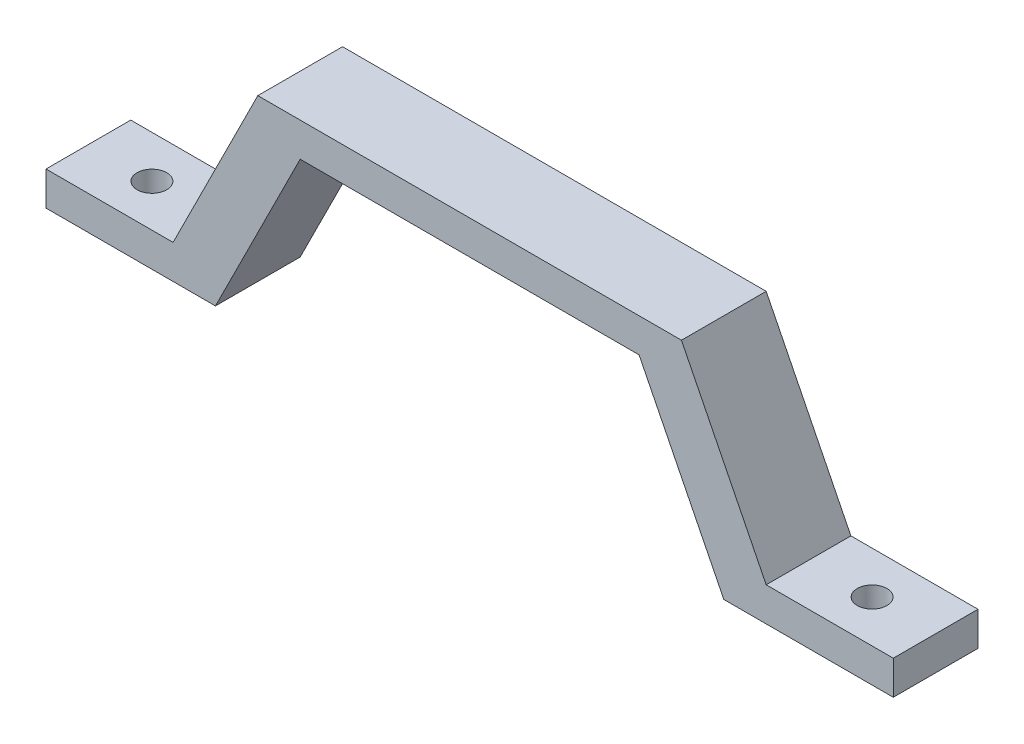
ISO-10303-21;
HEADER;
FILE_DESCRIPTION(('STEP AP214'),'2;1');
FILE_NAME('part.step','',(''),(''),'','','');
FILE_SCHEMA(('AUTOMOTIVE_DESIGN { 1 0 10303 214 1 1 1 1 }'));
ENDSEC;
DATA;
#1=APPLICATION_CONTEXT('core data for automotive mechanical design processes');
#2=APPLICATION_PROTOCOL_DEFINITION('international standard','automotive_design',2000,#1);
#3=PRODUCT_CONTEXT('',#1,'mechanical');
#4=PRODUCT('Part','Part','',(#3));
#5=PRODUCT_RELATED_PRODUCT_CATEGORY('part','',(#4));
#6=PRODUCT_DEFINITION_FORMATION('','',#4);
#7=PRODUCT_DEFINITION_CONTEXT('part definition',#1,'design');
#8=PRODUCT_DEFINITION('design','',#6,#7);
#9=PRODUCT_DEFINITION_SHAPE('','',#8);
#10=(LENGTH_UNIT() NAMED_UNIT(*) SI_UNIT(.MILLI.,.METRE.));
#11=(NAMED_UNIT(*) PLANE_ANGLE_UNIT() SI_UNIT($,.RADIAN.));
#12=(NAMED_UNIT(*) SI_UNIT($,.STERADIAN.) SOLID_ANGLE_UNIT());
#13=UNCERTAINTY_MEASURE_WITH_UNIT(LENGTH_MEASURE(1.E-05),#10,'distance_accuracy_value','');
#14=(GEOMETRIC_REPRESENTATION_CONTEXT(3) GLOBAL_UNCERTAINTY_ASSIGNED_CONTEXT((#13)) GLOBAL_UNIT_ASSIGNED_CONTEXT((#10,
#11,#12)) REPRESENTATION_CONTEXT('',''));
#15=CARTESIAN_POINT('',(0.,0.,0.));
#16=DIRECTION('',(0.,0.,1.));
#17=DIRECTION('',(1.,0.,0.));
#18=AXIS2_PLACEMENT_3D('',#15,#16,#17);
#19=CARTESIAN_POINT('',(20.,20.,10.));
#20=DIRECTION('',(0.,1.,0.));
#21=DIRECTION('',(0.,0.,1.));
#22=AXIS2_PLACEMENT_3D('',#19,#20,#21);
#23=PLANE('',#22);
#24=DIRECTION('',(1.,0.,0.));
#25=VECTOR('',#24,1.);
#26=CARTESIAN_POINT('',(20.,20.,0.));
#27=LINE('',#26,#25);
#28=CARTESIAN_POINT('',(-20.,20.,0.));
#29=VERTEX_POINT('',#28);
#30=CARTESIAN_POINT('',(20.,20.,0.));
#31=VERTEX_POINT('',#30);
#32=EDGE_CURVE('E157',#29,#31,#27,.T.);
#33=ORIENTED_EDGE('',*,*,#32,.T.);
#34=DIRECTION('',(0.,0.,-1.));
#35=VECTOR('',#34,1.);
#36=CARTESIAN_POINT('',(20.,20.,10.));
#37=LINE('',#36,#35);
#38=CARTESIAN_POINT('',(20.,20.,10.));
#39=VERTEX_POINT('',#38);
#40=EDGE_CURVE('E11',#39,#31,#37,.T.);
#41=ORIENTED_EDGE('',*,*,#40,.F.);
#42=DIRECTION('',(1.,0.,0.));
#43=VECTOR('',#42,1.);
#44=CARTESIAN_POINT('',(20.,20.,10.));
#45=LINE('',#44,#43);
#46=CARTESIAN_POINT('',(-20.,20.,10.));
#47=VERTEX_POINT('',#46);
#48=EDGE_CURVE('E180',#47,#39,#45,.T.);
#49=ORIENTED_EDGE('',*,*,#48,.F.);
#50=DIRECTION('',(0.,0.,-1.));
#51=VECTOR('',#50,1.);
#52=CARTESIAN_POINT('',(-20.,20.,10.));
#53=LINE('',#52,#51);
#54=EDGE_CURVE('E153',#47,#29,#53,.T.);
#55=ORIENTED_EDGE('',*,*,#54,.T.);
#56=EDGE_LOOP('',(#33,#41,#49,#55));
#57=FACE_BOUND('',#56,.T.);
#58=ADVANCED_FACE('F37',(#57),#23,.F.);
#59=CARTESIAN_POINT('',(20.,20.,10.));
#60=DIRECTION('',(0.894427190999916,0.447213595499958,0.));
#61=DIRECTION('',(-0.447213595499958,0.894427190999916,0.));
#62=AXIS2_PLACEMENT_3D('',#59,#60,#61);
#63=PLANE('',#62);
#64=DIRECTION('',(0.447213595499958,-0.894427190999916,0.));
#65=VECTOR('',#64,1.);
#66=CARTESIAN_POINT('',(20.,20.,0.));
#67=LINE('',#66,#65);
#68=CARTESIAN_POINT('',(30.,0.,0.));
#69=VERTEX_POINT('',#68);
#70=EDGE_CURVE('E160',#31,#69,#67,.T.);
#71=ORIENTED_EDGE('',*,*,#70,.T.);
#72=DIRECTION('',(0.,0.,-1.));
#73=VECTOR('',#72,1.);
#74=CARTESIAN_POINT('',(30.,0.,10.));
#75=LINE('',#74,#73);
#76=CARTESIAN_POINT('',(30.,0.,10.));
#77=VERTEX_POINT('',#76);
#78=EDGE_CURVE('E45',#77,#69,#75,.T.);
#79=ORIENTED_EDGE('',*,*,#78,.F.);
#80=DIRECTION('',(0.447213595499958,-0.894427190999916,0.));
#81=VECTOR('',#80,1.);
#82=CARTESIAN_POINT('',(20.,20.,10.));
#83=LINE('',#82,#81);
#84=EDGE_CURVE('E108',#39,#77,#83,.T.);
#85=ORIENTED_EDGE('',*,*,#84,.F.);
#86=ORIENTED_EDGE('',*,*,#40,.T.);
#87=EDGE_LOOP('',(#71,#79,#85,#86));
#88=FACE_BOUND('',#87,.T.);
#89=ADVANCED_FACE('F259',(#88),#63,.F.);
#90=CARTESIAN_POINT('',(30.,0.,10.));
#91=DIRECTION('',(0.,1.,0.));
#92=DIRECTION('',(-1.,0.,0.));
#93=AXIS2_PLACEMENT_3D('',#90,#91,#92);
#94=PLANE('',#93);
#95=CARTESIAN_POINT('',(42.5,0.,5.));
#96=DIRECTION('',(0.,1.,0.));
#97=DIRECTION('',(-1.,0.,0.));
#98=AXIS2_PLACEMENT_3D('',#95,#96,#97);
#99=CIRCLE('',#98,1.75);
#100=CARTESIAN_POINT('',(40.75,0.,5.));
#101=VERTEX_POINT('',#100);
#102=EDGE_CURVE('E161',#101,#101,#99,.T.);
#103=ORIENTED_EDGE('',*,*,#102,.T.);
#104=EDGE_LOOP('',(#103));
#105=FACE_BOUND('',#104,.T.);
#106=DIRECTION('',(1.,0.,0.));
#107=VECTOR('',#106,1.);
#108=CARTESIAN_POINT('',(30.,0.,0.));
#109=LINE('',#108,#107);
#110=CARTESIAN_POINT('',(50.,0.,0.));
#111=VERTEX_POINT('',#110);
#112=EDGE_CURVE('E163',#69,#111,#109,.T.);
#113=ORIENTED_EDGE('',*,*,#112,.T.);
#114=DIRECTION('',(0.,0.,-1.));
#115=VECTOR('',#114,1.);
#116=CARTESIAN_POINT('',(50.,0.,10.));
#117=LINE('',#116,#115);
#118=CARTESIAN_POINT('',(50.,0.,10.));
#119=VERTEX_POINT('',#118);
#120=EDGE_CURVE('E199',#119,#111,#117,.T.);
#121=ORIENTED_EDGE('',*,*,#120,.F.);
#122=DIRECTION('',(1.,0.,0.));
#123=VECTOR('',#122,1.);
#124=CARTESIAN_POINT('',(30.,0.,10.));
#125=LINE('',#124,#123);
#126=EDGE_CURVE('E207',#77,#119,#125,.T.);
#127=ORIENTED_EDGE('',*,*,#126,.F.);
#128=ORIENTED_EDGE('',*,*,#78,.T.);
#129=EDGE_LOOP('',(#113,#121,#127,#128));
#130=FACE_BOUND('',#129,.T.);
#131=ADVANCED_FACE('F205',(#105,#130),#94,.F.);
#132=CARTESIAN_POINT('',(50.,0.,10.));
#133=DIRECTION('',(-1.,0.,0.));
#134=DIRECTION('',(0.,0.,1.));
#135=AXIS2_PLACEMENT_3D('',#132,#133,#134);
#136=PLANE('',#135);
#137=DIRECTION('',(0.,1.,0.));
#138=VECTOR('',#137,1.);
#139=CARTESIAN_POINT('',(50.,0.,0.));
#140=LINE('',#139,#138);
#141=CARTESIAN_POINT('',(50.,4.,0.));
#142=VERTEX_POINT('',#141);
#143=EDGE_CURVE('E165',#111,#142,#140,.T.);
#144=ORIENTED_EDGE('',*,*,#143,.T.);
#145=DIRECTION('',(0.,0.,-1.));
#146=VECTOR('',#145,1.);
#147=CARTESIAN_POINT('',(50.,4.,10.));
#148=LINE('',#147,#146);
#149=CARTESIAN_POINT('',(50.,4.,10.));
#150=VERTEX_POINT('',#149);
#151=EDGE_CURVE('E196',#150,#142,#148,.T.);
#152=ORIENTED_EDGE('',*,*,#151,.F.);
#153=DIRECTION('',(0.,1.,0.));
#154=VECTOR('',#153,1.);
#155=CARTESIAN_POINT('',(50.,0.,10.));
#156=LINE('',#155,#154);
#157=EDGE_CURVE('E225',#119,#150,#156,.T.);
#158=ORIENTED_EDGE('',*,*,#157,.F.);
#159=ORIENTED_EDGE('',*,*,#120,.T.);
#160=EDGE_LOOP('',(#144,#152,#158,#159));
#161=FACE_BOUND('',#160,.T.);
#162=ADVANCED_FACE('F216',(#161),#136,.F.);
#163=CARTESIAN_POINT('',(50.,4.,10.));
#164=DIRECTION('',(0.,-1.,0.));
#165=DIRECTION('',(1.,0.,0.));
#166=AXIS2_PLACEMENT_3D('',#163,#164,#165);
#167=PLANE('',#166);
#168=CARTESIAN_POINT('',(42.5,4.,5.));
#169=DIRECTION('',(0.,1.,0.));
#170=DIRECTION('',(-1.,0.,0.));
#171=AXIS2_PLACEMENT_3D('',#168,#169,#170);
#172=CIRCLE('',#171,1.75);
#173=CARTESIAN_POINT('',(40.75,4.,5.));
#174=VERTEX_POINT('',#173);
#175=EDGE_CURVE('E395',#174,#174,#172,.T.);
#176=ORIENTED_EDGE('',*,*,#175,.F.);
#177=EDGE_LOOP('',(#176));
#178=FACE_BOUND('',#177,.T.);
#179=DIRECTION('',(-1.,0.,0.));
#180=VECTOR('',#179,1.);
#181=CARTESIAN_POINT('',(50.,4.,0.));
#182=LINE('',#181,#180);
#183=CARTESIAN_POINT('',(35.,4.,0.));
#184=VERTEX_POINT('',#183);
#185=EDGE_CURVE('E167',#142,#184,#182,.T.);
#186=ORIENTED_EDGE('',*,*,#185,.T.);
#187=DIRECTION('',(0.,0.,-1.));
#188=VECTOR('',#187,1.);
#189=CARTESIAN_POINT('',(35.,4.,10.));
#190=LINE('',#189,#188);
#191=CARTESIAN_POINT('',(35.,4.,10.));
#192=VERTEX_POINT('',#191);
#193=EDGE_CURVE('E193',#192,#184,#190,.T.);
#194=ORIENTED_EDGE('',*,*,#193,.F.);
#195=DIRECTION('',(-1.,0.,0.));
#196=VECTOR('',#195,1.);
#197=CARTESIAN_POINT('',(50.,4.,10.));
#198=LINE('',#197,#196);
#199=EDGE_CURVE('E222',#150,#192,#198,.T.);
#200=ORIENTED_EDGE('',*,*,#199,.F.);
#201=ORIENTED_EDGE('',*,*,#151,.T.);
#202=EDGE_LOOP('',(#186,#194,#200,#201));
#203=FACE_BOUND('',#202,.T.);
#204=ADVANCED_FACE('F220',(#178,#203),#167,.F.);
#205=CARTESIAN_POINT('',(35.,4.,10.));
#206=DIRECTION('',(-0.894427190999916,-0.447213595499958,0.));
#207=DIRECTION('',(0.447213595499958,-0.894427190999916,0.));
#208=AXIS2_PLACEMENT_3D('',#205,#206,#207);
#209=PLANE('',#208);
#210=DIRECTION('',(-0.447213595499958,0.894427190999916,0.));
#211=VECTOR('',#210,1.);
#212=CARTESIAN_POINT('',(35.,4.,0.));
#213=LINE('',#212,#211);
#214=CARTESIAN_POINT('',(25.,24.,0.));
#215=VERTEX_POINT('',#214);
#216=EDGE_CURVE('E169',#184,#215,#213,.T.);
#217=ORIENTED_EDGE('',*,*,#216,.T.);
#218=DIRECTION('',(0.,0.,-1.));
#219=VECTOR('',#218,1.);
#220=CARTESIAN_POINT('',(25.,24.,10.));
#221=LINE('',#220,#219);
#222=CARTESIAN_POINT('',(25.,24.,10.));
#223=VERTEX_POINT('',#222);
#224=EDGE_CURVE('E190',#223,#215,#221,.T.);
#225=ORIENTED_EDGE('',*,*,#224,.F.);
#226=DIRECTION('',(-0.447213595499958,0.894427190999916,0.));
#227=VECTOR('',#226,1.);
#228=CARTESIAN_POINT('',(35.,4.,10.));
#229=LINE('',#228,#227);
#230=EDGE_CURVE('E224',#192,#223,#229,.T.);
#231=ORIENTED_EDGE('',*,*,#230,.F.);
#232=ORIENTED_EDGE('',*,*,#193,.T.);
#233=EDGE_LOOP('',(#217,#225,#231,#232));
#234=FACE_BOUND('',#233,.T.);
#235=ADVANCED_FACE('F273',(#234),#209,.F.);
#236=CARTESIAN_POINT('',(-25.,24.,10.));
#237=DIRECTION('',(0.,-1.,0.));
#238=DIRECTION('',(0.,0.,-1.));
#239=AXIS2_PLACEMENT_3D('',#236,#237,#238);
#240=PLANE('',#239);
#241=DIRECTION('',(-1.,0.,0.));
#242=VECTOR('',#241,1.);
#243=CARTESIAN_POINT('',(-25.,24.,0.));
#244=LINE('',#243,#242);
#245=CARTESIAN_POINT('',(-25.,24.,0.));
#246=VERTEX_POINT('',#245);
#247=EDGE_CURVE('E171',#215,#246,#244,.T.);
#248=ORIENTED_EDGE('',*,*,#247,.T.);
#249=DIRECTION('',(0.,0.,-1.));
#250=VECTOR('',#249,1.);
#251=CARTESIAN_POINT('',(-25.,24.,10.));
#252=LINE('',#251,#250);
#253=CARTESIAN_POINT('',(-25.,24.,10.));
#254=VERTEX_POINT('',#253);
#255=EDGE_CURVE('E187',#254,#246,#252,.T.);
#256=ORIENTED_EDGE('',*,*,#255,.F.);
#257=DIRECTION('',(-1.,0.,0.));
#258=VECTOR('',#257,1.);
#259=CARTESIAN_POINT('',(-25.,24.,10.));
#260=LINE('',#259,#258);
#261=EDGE_CURVE('E227',#223,#254,#260,.T.);
#262=ORIENTED_EDGE('',*,*,#261,.F.);
#263=ORIENTED_EDGE('',*,*,#224,.T.);
#264=EDGE_LOOP('',(#248,#256,#262,#263));
#265=FACE_BOUND('',#264,.T.);
#266=ADVANCED_FACE('F277',(#265),#240,.F.);
#267=CARTESIAN_POINT('',(-35.,4.,10.));
#268=DIRECTION('',(0.894427190999916,-0.447213595499958,0.));
#269=DIRECTION('',(0.447213595499958,0.894427190999916,0.));
#270=AXIS2_PLACEMENT_3D('',#267,#268,#269);
#271=PLANE('',#270);
#272=DIRECTION('',(-0.447213595499958,-0.894427190999916,0.));
#273=VECTOR('',#272,1.);
#274=CARTESIAN_POINT('',(-35.,4.,0.));
#275=LINE('',#274,#273);
#276=CARTESIAN_POINT('',(-35.,4.,0.));
#277=VERTEX_POINT('',#276);
#278=EDGE_CURVE('E173',#246,#277,#275,.T.);
#279=ORIENTED_EDGE('',*,*,#278,.T.);
#280=DIRECTION('',(0.,0.,-1.));
#281=VECTOR('',#280,1.);
#282=CARTESIAN_POINT('',(-35.,4.,10.));
#283=LINE('',#282,#281);
#284=CARTESIAN_POINT('',(-35.,4.,10.));
#285=VERTEX_POINT('',#284);
#286=EDGE_CURVE('E184',#285,#277,#283,.T.);
#287=ORIENTED_EDGE('',*,*,#286,.F.);
#288=DIRECTION('',(-0.447213595499958,-0.894427190999916,0.));
#289=VECTOR('',#288,1.);
#290=CARTESIAN_POINT('',(-35.,4.,10.));
#291=LINE('',#290,#289);
#292=EDGE_CURVE('E233',#254,#285,#291,.T.);
#293=ORIENTED_EDGE('',*,*,#292,.F.);
#294=ORIENTED_EDGE('',*,*,#255,.T.);
#295=EDGE_LOOP('',(#279,#287,#293,#294));
#296=FACE_BOUND('',#295,.T.);
#297=ADVANCED_FACE('F239',(#296),#271,.F.);
#298=CARTESIAN_POINT('',(-50.,4.,10.));
#299=DIRECTION('',(0.,-1.,0.));
#300=DIRECTION('',(1.,0.,0.));
#301=AXIS2_PLACEMENT_3D('',#298,#299,#300);
#302=PLANE('',#301);
#303=CARTESIAN_POINT('',(-42.5,3.99999999999999,5.));
#304=DIRECTION('',(0.,1.,0.));
#305=DIRECTION('',(-1.,0.,0.));
#306=AXIS2_PLACEMENT_3D('',#303,#304,#305);
#307=CIRCLE('',#306,1.75);
#308=CARTESIAN_POINT('',(-44.25,3.99999999999999,5.));
#309=VERTEX_POINT('',#308);
#310=EDGE_CURVE('E393',#309,#309,#307,.T.);
#311=ORIENTED_EDGE('',*,*,#310,.F.);
#312=EDGE_LOOP('',(#311));
#313=FACE_BOUND('',#312,.T.);
#314=DIRECTION('',(-1.,0.,0.));
#315=VECTOR('',#314,1.);
#316=CARTESIAN_POINT('',(-50.,4.,0.));
#317=LINE('',#316,#315);
#318=CARTESIAN_POINT('',(-50.,4.,0.));
#319=VERTEX_POINT('',#318);
#320=EDGE_CURVE('E175',#277,#319,#317,.T.);
#321=ORIENTED_EDGE('',*,*,#320,.T.);
#322=DIRECTION('',(0.,0.,-1.));
#323=VECTOR('',#322,1.);
#324=CARTESIAN_POINT('',(-50.,4.,10.));
#325=LINE('',#324,#323);
#326=CARTESIAN_POINT('',(-50.,4.,10.));
#327=VERTEX_POINT('',#326);
#328=EDGE_CURVE('E148',#327,#319,#325,.T.);
#329=ORIENTED_EDGE('',*,*,#328,.F.);
#330=DIRECTION('',(-1.,0.,0.));
#331=VECTOR('',#330,1.);
#332=CARTESIAN_POINT('',(-50.,4.,10.));
#333=LINE('',#332,#331);
#334=EDGE_CURVE('E139',#285,#327,#333,.T.);
#335=ORIENTED_EDGE('',*,*,#334,.F.);
#336=ORIENTED_EDGE('',*,*,#286,.T.);
#337=EDGE_LOOP('',(#321,#329,#335,#336));
#338=FACE_BOUND('',#337,.T.);
#339=ADVANCED_FACE('F243',(#313,#338),#302,.F.);
#340=CARTESIAN_POINT('',(-50.,0.,10.));
#341=DIRECTION('',(1.,0.,0.));
#342=DIRECTION('',(0.,0.,-1.));
#343=AXIS2_PLACEMENT_3D('',#340,#341,#342);
#344=PLANE('',#343);
#345=DIRECTION('',(0.,-1.,0.));
#346=VECTOR('',#345,1.);
#347=CARTESIAN_POINT('',(-50.,0.,0.));
#348=LINE('',#347,#346);
#349=CARTESIAN_POINT('',(-50.,0.,0.));
#350=VERTEX_POINT('',#349);
#351=EDGE_CURVE('E147',#319,#350,#348,.T.);
#352=ORIENTED_EDGE('',*,*,#351,.T.);
#353=DIRECTION('',(0.,0.,-1.));
#354=VECTOR('',#353,1.);
#355=CARTESIAN_POINT('',(-50.,0.,10.));
#356=LINE('',#355,#354);
#357=CARTESIAN_POINT('',(-50.,0.,10.));
#358=VERTEX_POINT('',#357);
#359=EDGE_CURVE('E144',#358,#350,#356,.T.);
#360=ORIENTED_EDGE('',*,*,#359,.F.);
#361=DIRECTION('',(0.,-1.,0.));
#362=VECTOR('',#361,1.);
#363=CARTESIAN_POINT('',(-50.,0.,10.));
#364=LINE('',#363,#362);
#365=EDGE_CURVE('E133',#327,#358,#364,.T.);
#366=ORIENTED_EDGE('',*,*,#365,.F.);
#367=ORIENTED_EDGE('',*,*,#328,.T.);
#368=EDGE_LOOP('',(#352,#360,#366,#367));
#369=FACE_BOUND('',#368,.T.);
#370=ADVANCED_FACE('F145',(#369),#344,.F.);
#371=CARTESIAN_POINT('',(-30.,0.,10.));
#372=DIRECTION('',(0.,1.,0.));
#373=DIRECTION('',(-1.,0.,0.));
#374=AXIS2_PLACEMENT_3D('',#371,#372,#373);
#375=PLANE('',#374);
#376=CARTESIAN_POINT('',(-42.5,0.,5.));
#377=DIRECTION('',(0.,1.,0.));
#378=DIRECTION('',(-1.,0.,0.));
#379=AXIS2_PLACEMENT_3D('',#376,#377,#378);
#380=CIRCLE('',#379,1.75);
#381=CARTESIAN_POINT('',(-44.25,0.,5.));
#382=VERTEX_POINT('',#381);
#383=EDGE_CURVE('E390',#382,#382,#380,.T.);
#384=ORIENTED_EDGE('',*,*,#383,.T.);
#385=EDGE_LOOP('',(#384));
#386=FACE_BOUND('',#385,.T.);
#387=DIRECTION('',(1.,0.,0.));
#388=VECTOR('',#387,1.);
#389=CARTESIAN_POINT('',(-30.,0.,0.));
#390=LINE('',#389,#388);
#391=CARTESIAN_POINT('',(-30.,0.,0.));
#392=VERTEX_POINT('',#391);
#393=EDGE_CURVE('E94',#350,#392,#390,.T.);
#394=ORIENTED_EDGE('',*,*,#393,.T.);
#395=DIRECTION('',(0.,0.,-1.));
#396=VECTOR('',#395,1.);
#397=CARTESIAN_POINT('',(-30.,0.,10.));
#398=LINE('',#397,#396);
#399=CARTESIAN_POINT('',(-30.,0.,10.));
#400=VERTEX_POINT('',#399);
#401=EDGE_CURVE('E149',#400,#392,#398,.T.);
#402=ORIENTED_EDGE('',*,*,#401,.F.);
#403=DIRECTION('',(1.,0.,0.));
#404=VECTOR('',#403,1.);
#405=CARTESIAN_POINT('',(-30.,0.,10.));
#406=LINE('',#405,#404);
#407=EDGE_CURVE('E137',#358,#400,#406,.T.);
#408=ORIENTED_EDGE('',*,*,#407,.F.);
#409=ORIENTED_EDGE('',*,*,#359,.T.);
#410=EDGE_LOOP('',(#394,#402,#408,#409));
#411=FACE_BOUND('',#410,.T.);
#412=ADVANCED_FACE('F151',(#386,#411),#375,.F.);
#413=CARTESIAN_POINT('',(-20.,20.,10.));
#414=DIRECTION('',(-0.894427190999916,0.447213595499958,0.));
#415=DIRECTION('',(-0.447213595499958,-0.894427190999916,0.));
#416=AXIS2_PLACEMENT_3D('',#413,#414,#415);
#417=PLANE('',#416);
#418=DIRECTION('',(0.447213595499958,0.894427190999916,0.));
#419=VECTOR('',#418,1.);
#420=CARTESIAN_POINT('',(-20.,20.,0.));
#421=LINE('',#420,#419);
#422=EDGE_CURVE('E100',#392,#29,#421,.T.);
#423=ORIENTED_EDGE('',*,*,#422,.T.);
#424=ORIENTED_EDGE('',*,*,#54,.F.);
#425=DIRECTION('',(0.447213595499958,0.894427190999916,0.));
#426=VECTOR('',#425,1.);
#427=CARTESIAN_POINT('',(-20.,20.,10.));
#428=LINE('',#427,#426);
#429=EDGE_CURVE('E53',#400,#47,#428,.T.);
#430=ORIENTED_EDGE('',*,*,#429,.F.);
#431=ORIENTED_EDGE('',*,*,#401,.T.);
#432=EDGE_LOOP('',(#423,#424,#430,#431));
#433=FACE_BOUND('',#432,.T.);
#434=ADVANCED_FACE('F247',(#433),#417,.F.);
#435=CARTESIAN_POINT('',(0.,0.,10.));
#436=DIRECTION('',(0.,0.,-1.));
#437=DIRECTION('',(-1.,0.,0.));
#438=AXIS2_PLACEMENT_3D('',#435,#436,#437);
#439=PLANE('',#438);
#440=ORIENTED_EDGE('',*,*,#48,.T.);
#441=ORIENTED_EDGE('',*,*,#84,.T.);
#442=ORIENTED_EDGE('',*,*,#126,.T.);
#443=ORIENTED_EDGE('',*,*,#157,.T.);
#444=ORIENTED_EDGE('',*,*,#199,.T.);
#445=ORIENTED_EDGE('',*,*,#230,.T.);
#446=ORIENTED_EDGE('',*,*,#261,.T.);
#447=ORIENTED_EDGE('',*,*,#292,.T.);
#448=ORIENTED_EDGE('',*,*,#334,.T.);
#449=ORIENTED_EDGE('',*,*,#365,.T.);
#450=ORIENTED_EDGE('',*,*,#407,.T.);
#451=ORIENTED_EDGE('',*,*,#429,.T.);
#452=EDGE_LOOP('',(#440,#441,#442,#443,#444,#445,#446,#447,#448,#449,#450,#451));
#453=FACE_BOUND('',#452,.T.);
#454=ADVANCED_FACE('F135',(#453),#439,.F.);
#455=CARTESIAN_POINT('',(0.,0.,0.));
#456=DIRECTION('',(0.,0.,-1.));
#457=DIRECTION('',(-1.,0.,0.));
#458=AXIS2_PLACEMENT_3D('',#455,#456,#457);
#459=PLANE('',#458);
#460=ORIENTED_EDGE('',*,*,#32,.F.);
#461=ORIENTED_EDGE('',*,*,#422,.F.);
#462=ORIENTED_EDGE('',*,*,#393,.F.);
#463=ORIENTED_EDGE('',*,*,#351,.F.);
#464=ORIENTED_EDGE('',*,*,#320,.F.);
#465=ORIENTED_EDGE('',*,*,#278,.F.);
#466=ORIENTED_EDGE('',*,*,#247,.F.);
#467=ORIENTED_EDGE('',*,*,#216,.F.);
#468=ORIENTED_EDGE('',*,*,#185,.F.);
#469=ORIENTED_EDGE('',*,*,#143,.F.);
#470=ORIENTED_EDGE('',*,*,#112,.F.);
#471=ORIENTED_EDGE('',*,*,#70,.F.);
#472=EDGE_LOOP('',(#460,#461,#462,#463,#464,#465,#466,#467,#468,#469,#470,#471));
#473=FACE_BOUND('',#472,.T.);
#474=ADVANCED_FACE('F211',(#473),#459,.T.);
#475=CARTESIAN_POINT('',(42.5,0.,5.));
#476=DIRECTION('',(0.,1.,0.));
#477=DIRECTION('',(-1.,0.,0.));
#478=AXIS2_PLACEMENT_3D('',#475,#476,#477);
#479=CYLINDRICAL_SURFACE('',#478,1.75);
#480=ORIENTED_EDGE('',*,*,#102,.F.);
#481=EDGE_LOOP('',(#480));
#482=FACE_BOUND('',#481,.T.);
#483=ORIENTED_EDGE('',*,*,#175,.T.);
#484=EDGE_LOOP('',(#483));
#485=FACE_BOUND('',#484,.T.);
#486=ADVANCED_FACE('F306',(#482,#485),#479,.F.);
#487=CARTESIAN_POINT('',(-42.5,0.,5.));
#488=DIRECTION('',(0.,1.,0.));
#489=DIRECTION('',(-1.,0.,0.));
#490=AXIS2_PLACEMENT_3D('',#487,#488,#489);
#491=CYLINDRICAL_SURFACE('',#490,1.75);
#492=ORIENTED_EDGE('',*,*,#383,.F.);
#493=EDGE_LOOP('',(#492));
#494=FACE_BOUND('',#493,.T.);
#495=ORIENTED_EDGE('',*,*,#310,.T.);
#496=EDGE_LOOP('',(#495));
#497=FACE_BOUND('',#496,.T.);
#498=ADVANCED_FACE('F311',(#494,#497),#491,.F.);
#499=CLOSED_SHELL('',(#58,#89,#131,#162,#204,#235,#266,#297,#339,#370,#412,#434,#454,#474,#486,#498));
#500=MANIFOLD_SOLID_BREP('B2',#499);
#501=ADVANCED_BREP_SHAPE_REPRESENTATION('',(#18,#500),#14);
#502=SHAPE_DEFINITION_REPRESENTATION(#9,#501);
ENDSEC;
END-ISO-10303-21;
